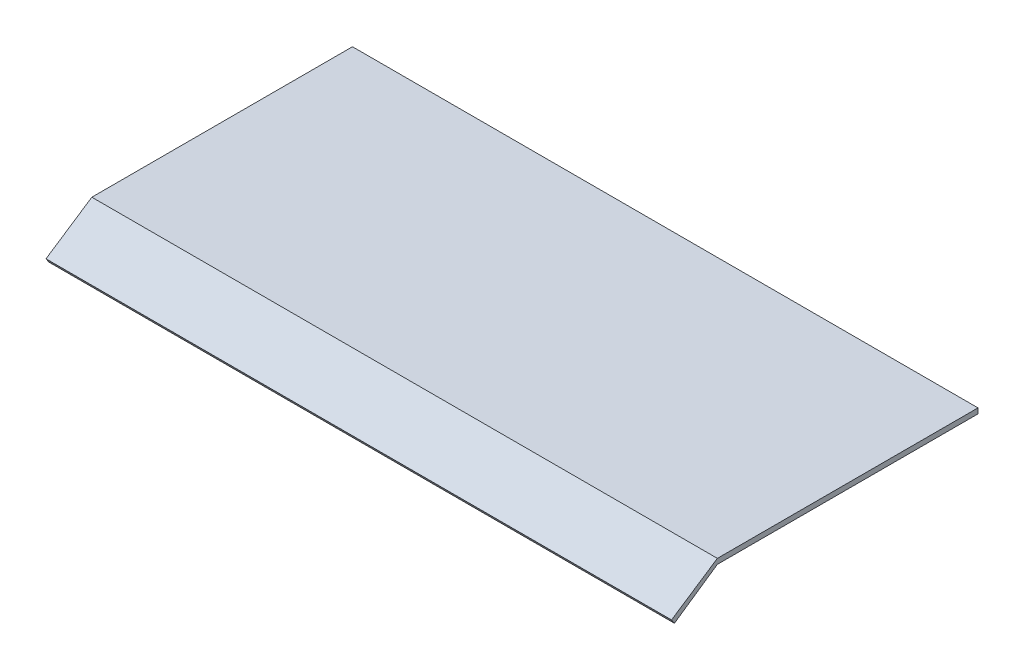
ISO-10303-21;
HEADER;
FILE_DESCRIPTION(('STEP AP214'),'2;1');
FILE_NAME('part.step','',(''),(''),'','','');
FILE_SCHEMA(('AUTOMOTIVE_DESIGN { 1 0 10303 214 1 1 1 1 }'));
ENDSEC;
DATA;
#1=APPLICATION_CONTEXT('core data for automotive mechanical design processes');
#2=APPLICATION_PROTOCOL_DEFINITION('international standard','automotive_design',2000,#1);
#3=PRODUCT_CONTEXT('',#1,'mechanical');
#4=PRODUCT('Part','Part','',(#3));
#5=PRODUCT_RELATED_PRODUCT_CATEGORY('part','',(#4));
#6=PRODUCT_DEFINITION_FORMATION('','',#4);
#7=PRODUCT_DEFINITION_CONTEXT('part definition',#1,'design');
#8=PRODUCT_DEFINITION('design','',#6,#7);
#9=PRODUCT_DEFINITION_SHAPE('','',#8);
#10=(LENGTH_UNIT() NAMED_UNIT(*) SI_UNIT(.MILLI.,.METRE.));
#11=(NAMED_UNIT(*) PLANE_ANGLE_UNIT() SI_UNIT($,.RADIAN.));
#12=(NAMED_UNIT(*) SI_UNIT($,.STERADIAN.) SOLID_ANGLE_UNIT());
#13=UNCERTAINTY_MEASURE_WITH_UNIT(LENGTH_MEASURE(1.E-05),#10,'distance_accuracy_value','');
#14=(GEOMETRIC_REPRESENTATION_CONTEXT(3) GLOBAL_UNCERTAINTY_ASSIGNED_CONTEXT((#13)) GLOBAL_UNIT_ASSIGNED_CONTEXT((#10,
#11,#12)) REPRESENTATION_CONTEXT('',''));
#15=CARTESIAN_POINT('',(0.,0.,0.));
#16=DIRECTION('',(0.,0.,1.));
#17=DIRECTION('',(1.,0.,0.));
#18=AXIS2_PLACEMENT_3D('',#15,#16,#17);
#19=CARTESIAN_POINT('',(304.8,-14.8197740483916,22.3309069399812));
#20=DIRECTION('',(0.,-0.833210832457255,-0.552955431003158));
#21=DIRECTION('',(0.,0.552955431003159,-0.833210832457255));
#22=AXIS2_PLACEMENT_3D('',#19,#20,#21);
#23=PLANE('',#22);
#24=DIRECTION('',(0.,-0.552955431003158,0.833210832457255));
#25=VECTOR('',#24,1.);
#26=CARTESIAN_POINT('',(0.,-14.8197740483916,22.3309069399812));
#27=LINE('',#26,#25);
#28=CARTESIAN_POINT('',(0.,0.,0.));
#29=VERTEX_POINT('',#28);
#30=CARTESIAN_POINT('',(0.,-14.8197740483916,22.3309069399812));
#31=VERTEX_POINT('',#30);
#32=EDGE_CURVE('E133',#29,#31,#27,.T.);
#33=ORIENTED_EDGE('',*,*,#32,.T.);
#34=DIRECTION('',(-1.,0.,0.));
#35=VECTOR('',#34,1.);
#36=CARTESIAN_POINT('',(304.8,-14.8197740483916,22.3309069399812));
#37=LINE('',#36,#35);
#38=CARTESIAN_POINT('',(304.8,-14.8197740483916,22.3309069399812));
#39=VERTEX_POINT('',#38);
#40=EDGE_CURVE('E11',#39,#31,#37,.T.);
#41=ORIENTED_EDGE('',*,*,#40,.F.);
#42=DIRECTION('',(0.,-0.552955431003158,0.833210832457255));
#43=VECTOR('',#42,1.);
#44=CARTESIAN_POINT('',(304.8,-14.8197740483916,22.3309069399812));
#45=LINE('',#44,#43);
#46=CARTESIAN_POINT('',(304.8,0.,0.));
#47=VERTEX_POINT('',#46);
#48=EDGE_CURVE('E145',#47,#39,#45,.T.);
#49=ORIENTED_EDGE('',*,*,#48,.F.);
#50=DIRECTION('',(-1.,0.,0.));
#51=VECTOR('',#50,1.);
#52=CARTESIAN_POINT('',(304.8,0.,0.));
#53=LINE('',#52,#51);
#54=EDGE_CURVE('E129',#47,#29,#53,.T.);
#55=ORIENTED_EDGE('',*,*,#54,.T.);
#56=EDGE_LOOP('',(#33,#41,#49,#55));
#57=FACE_BOUND('',#56,.T.);
#58=ADVANCED_FACE('F41',(#57),#23,.F.);
#59=CARTESIAN_POINT('',(304.8,-16.9333955620829,20.9282145486282));
#60=DIRECTION('',(0.,0.552955431003158,-0.833210832457255));
#61=DIRECTION('',(0.,0.833210832457255,0.552955431003158));
#62=AXIS2_PLACEMENT_3D('',#59,#60,#61);
#63=PLANE('',#62);
#64=DIRECTION('',(0.,-0.833210832457255,-0.552955431003158));
#65=VECTOR('',#64,1.);
#66=CARTESIAN_POINT('',(0.,-16.9333955620829,20.9282145486282));
#67=LINE('',#66,#65);
#68=CARTESIAN_POINT('',(0.,-16.9333955620829,20.9282145486282));
#69=VERTEX_POINT('',#68);
#70=EDGE_CURVE('E136',#31,#69,#67,.T.);
#71=ORIENTED_EDGE('',*,*,#70,.T.);
#72=DIRECTION('',(-1.,0.,0.));
#73=VECTOR('',#72,1.);
#74=CARTESIAN_POINT('',(304.8,-16.9333955620829,20.9282145486282));
#75=LINE('',#74,#73);
#76=CARTESIAN_POINT('',(304.8,-16.9333955620829,20.9282145486282));
#77=VERTEX_POINT('',#76);
#78=EDGE_CURVE('E50',#77,#69,#75,.T.);
#79=ORIENTED_EDGE('',*,*,#78,.F.);
#80=DIRECTION('',(0.,-0.833210832457255,-0.552955431003158));
#81=VECTOR('',#80,1.);
#82=CARTESIAN_POINT('',(304.8,-16.9333955620829,20.9282145486282));
#83=LINE('',#82,#81);
#84=EDGE_CURVE('E97',#39,#77,#83,.T.);
#85=ORIENTED_EDGE('',*,*,#84,.F.);
#86=ORIENTED_EDGE('',*,*,#40,.T.);
#87=EDGE_LOOP('',(#71,#79,#85,#86));
#88=FACE_BOUND('',#87,.T.);
#89=ADVANCED_FACE('F173',(#88),#63,.F.);
#90=CARTESIAN_POINT('',(304.8,-2.54,0.));
#91=DIRECTION('',(0.,0.8239454546704,0.566669116617438));
#92=DIRECTION('',(0.,-0.566669116617438,0.8239454546704));
#93=AXIS2_PLACEMENT_3D('',#90,#91,#92);
#94=PLANE('',#93);
#95=DIRECTION('',(0.,0.566669116617438,-0.8239454546704));
#96=VECTOR('',#95,1.);
#97=CARTESIAN_POINT('',(0.,-2.54,0.));
#98=LINE('',#97,#96);
#99=CARTESIAN_POINT('',(0.,-2.54,0.));
#100=VERTEX_POINT('',#99);
#101=EDGE_CURVE('E139',#69,#100,#98,.T.);
#102=ORIENTED_EDGE('',*,*,#101,.T.);
#103=DIRECTION('',(-1.,0.,0.));
#104=VECTOR('',#103,1.);
#105=CARTESIAN_POINT('',(304.8,-2.54,0.));
#106=LINE('',#105,#104);
#107=CARTESIAN_POINT('',(304.8,-2.54,0.));
#108=VERTEX_POINT('',#107);
#109=EDGE_CURVE('E122',#108,#100,#106,.T.);
#110=ORIENTED_EDGE('',*,*,#109,.F.);
#111=DIRECTION('',(0.,0.566669116617438,-0.8239454546704));
#112=VECTOR('',#111,1.);
#113=CARTESIAN_POINT('',(304.8,-2.54,0.));
#114=LINE('',#113,#112);
#115=EDGE_CURVE('E111',#77,#108,#114,.T.);
#116=ORIENTED_EDGE('',*,*,#115,.F.);
#117=ORIENTED_EDGE('',*,*,#78,.T.);
#118=EDGE_LOOP('',(#102,#110,#116,#117));
#119=FACE_BOUND('',#118,.T.);
#120=ADVANCED_FACE('F155',(#119),#94,.F.);
#121=CARTESIAN_POINT('',(304.8,-2.54,-127.));
#122=DIRECTION('',(0.,1.,0.));
#123=DIRECTION('',(0.,0.,1.));
#124=AXIS2_PLACEMENT_3D('',#121,#122,#123);
#125=PLANE('',#124);
#126=DIRECTION('',(0.,0.,-1.));
#127=VECTOR('',#126,1.);
#128=CARTESIAN_POINT('',(0.,-2.54,-127.));
#129=LINE('',#128,#127);
#130=CARTESIAN_POINT('',(0.,-2.54,-127.));
#131=VERTEX_POINT('',#130);
#132=EDGE_CURVE('E120',#100,#131,#129,.T.);
#133=ORIENTED_EDGE('',*,*,#132,.T.);
#134=DIRECTION('',(-1.,0.,0.));
#135=VECTOR('',#134,1.);
#136=CARTESIAN_POINT('',(304.8,-2.54,-127.));
#137=LINE('',#136,#135);
#138=CARTESIAN_POINT('',(304.8,-2.54,-127.));
#139=VERTEX_POINT('',#138);
#140=EDGE_CURVE('E117',#139,#131,#137,.T.);
#141=ORIENTED_EDGE('',*,*,#140,.F.);
#142=DIRECTION('',(0.,0.,-1.));
#143=VECTOR('',#142,1.);
#144=CARTESIAN_POINT('',(304.8,-2.54,-127.));
#145=LINE('',#144,#143);
#146=EDGE_CURVE('E105',#108,#139,#145,.T.);
#147=ORIENTED_EDGE('',*,*,#146,.F.);
#148=ORIENTED_EDGE('',*,*,#109,.T.);
#149=EDGE_LOOP('',(#133,#141,#147,#148));
#150=FACE_BOUND('',#149,.T.);
#151=ADVANCED_FACE('F118',(#150),#125,.F.);
#152=CARTESIAN_POINT('',(304.8,0.,-127.));
#153=DIRECTION('',(0.,0.,1.));
#154=DIRECTION('',(1.,0.,0.));
#155=AXIS2_PLACEMENT_3D('',#152,#153,#154);
#156=PLANE('',#155);
#157=DIRECTION('',(0.,1.,0.));
#158=VECTOR('',#157,1.);
#159=CARTESIAN_POINT('',(0.,0.,-127.));
#160=LINE('',#159,#158);
#161=CARTESIAN_POINT('',(0.,0.,-127.));
#162=VERTEX_POINT('',#161);
#163=EDGE_CURVE('E83',#131,#162,#160,.T.);
#164=ORIENTED_EDGE('',*,*,#163,.T.);
#165=DIRECTION('',(-1.,0.,0.));
#166=VECTOR('',#165,1.);
#167=CARTESIAN_POINT('',(304.8,0.,-127.));
#168=LINE('',#167,#166);
#169=CARTESIAN_POINT('',(304.8,0.,-127.));
#170=VERTEX_POINT('',#169);
#171=EDGE_CURVE('E123',#170,#162,#168,.T.);
#172=ORIENTED_EDGE('',*,*,#171,.F.);
#173=DIRECTION('',(0.,1.,0.));
#174=VECTOR('',#173,1.);
#175=CARTESIAN_POINT('',(304.8,0.,-127.));
#176=LINE('',#175,#174);
#177=EDGE_CURVE('E109',#139,#170,#176,.T.);
#178=ORIENTED_EDGE('',*,*,#177,.F.);
#179=ORIENTED_EDGE('',*,*,#140,.T.);
#180=EDGE_LOOP('',(#164,#172,#178,#179));
#181=FACE_BOUND('',#180,.T.);
#182=ADVANCED_FACE('F125',(#181),#156,.F.);
#183=CARTESIAN_POINT('',(304.8,0.,0.));
#184=DIRECTION('',(0.,-1.,0.));
#185=DIRECTION('',(0.,0.,-1.));
#186=AXIS2_PLACEMENT_3D('',#183,#184,#185);
#187=PLANE('',#186);
#188=DIRECTION('',(0.,0.,1.));
#189=VECTOR('',#188,1.);
#190=CARTESIAN_POINT('',(0.,0.,0.));
#191=LINE('',#190,#189);
#192=EDGE_CURVE('E89',#162,#29,#191,.T.);
#193=ORIENTED_EDGE('',*,*,#192,.T.);
#194=ORIENTED_EDGE('',*,*,#54,.F.);
#195=DIRECTION('',(0.,0.,1.));
#196=VECTOR('',#195,1.);
#197=CARTESIAN_POINT('',(304.8,0.,0.));
#198=LINE('',#197,#196);
#199=EDGE_CURVE('E58',#170,#47,#198,.T.);
#200=ORIENTED_EDGE('',*,*,#199,.F.);
#201=ORIENTED_EDGE('',*,*,#171,.T.);
#202=EDGE_LOOP('',(#193,#194,#200,#201));
#203=FACE_BOUND('',#202,.T.);
#204=ADVANCED_FACE('F162',(#203),#187,.F.);
#205=CARTESIAN_POINT('',(304.8,0.,0.));
#206=DIRECTION('',(1.,0.,0.));
#207=DIRECTION('',(0.,0.,-1.));
#208=AXIS2_PLACEMENT_3D('',#205,#206,#207);
#209=PLANE('',#208);
#210=ORIENTED_EDGE('',*,*,#48,.T.);
#211=ORIENTED_EDGE('',*,*,#84,.T.);
#212=ORIENTED_EDGE('',*,*,#115,.T.);
#213=ORIENTED_EDGE('',*,*,#146,.T.);
#214=ORIENTED_EDGE('',*,*,#177,.T.);
#215=ORIENTED_EDGE('',*,*,#199,.T.);
#216=EDGE_LOOP('',(#210,#211,#212,#213,#214,#215));
#217=FACE_BOUND('',#216,.T.);
#218=ADVANCED_FACE('F107',(#217),#209,.T.);
#219=CARTESIAN_POINT('',(0.,0.,0.));
#220=DIRECTION('',(1.,0.,0.));
#221=DIRECTION('',(0.,0.,-1.));
#222=AXIS2_PLACEMENT_3D('',#219,#220,#221);
#223=PLANE('',#222);
#224=ORIENTED_EDGE('',*,*,#32,.F.);
#225=ORIENTED_EDGE('',*,*,#192,.F.);
#226=ORIENTED_EDGE('',*,*,#163,.F.);
#227=ORIENTED_EDGE('',*,*,#132,.F.);
#228=ORIENTED_EDGE('',*,*,#101,.F.);
#229=ORIENTED_EDGE('',*,*,#70,.F.);
#230=EDGE_LOOP('',(#224,#225,#226,#227,#228,#229));
#231=FACE_BOUND('',#230,.T.);
#232=ADVANCED_FACE('F158',(#231),#223,.F.);
#233=CLOSED_SHELL('',(#58,#89,#120,#151,#182,#204,#218,#232));
#234=MANIFOLD_SOLID_BREP('B2',#233);
#235=ADVANCED_BREP_SHAPE_REPRESENTATION('',(#18,#234),#14);
#236=SHAPE_DEFINITION_REPRESENTATION(#9,#235);
ENDSEC;
END-ISO-10303-21;
